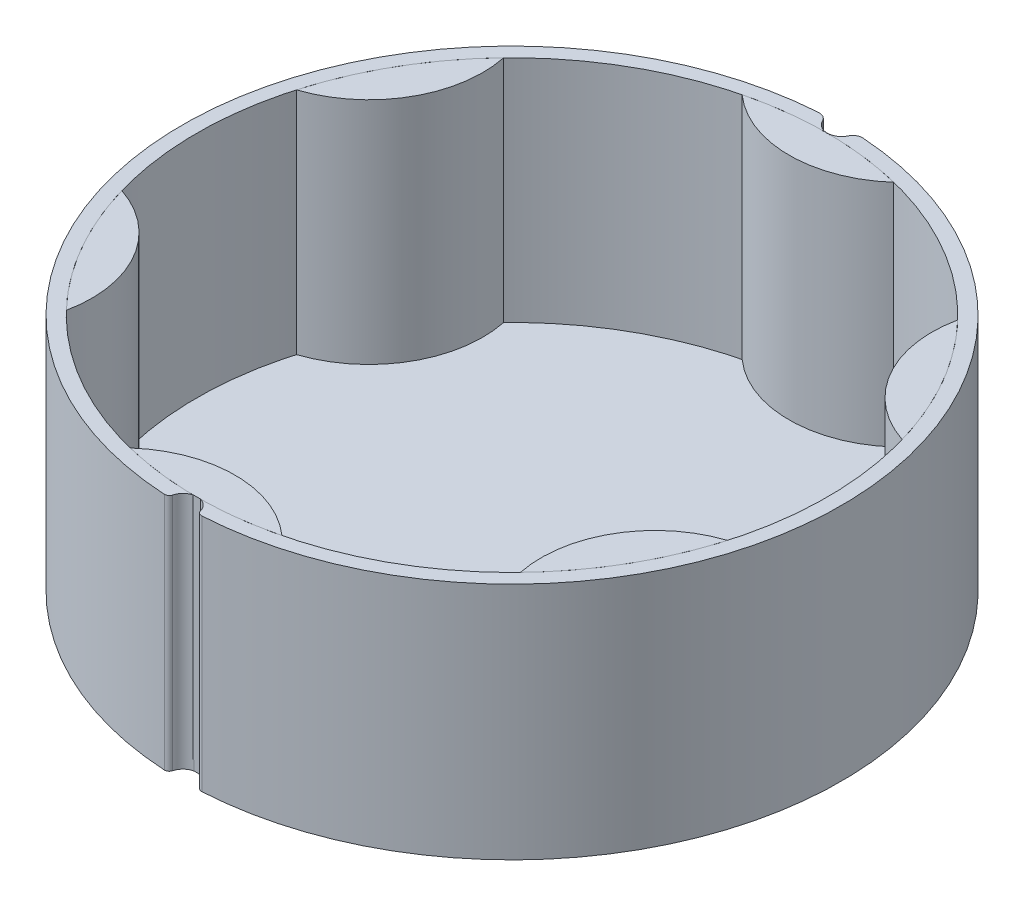
ISO-10303-21;
HEADER;
FILE_DESCRIPTION(('STEP AP214'),'2;1');
FILE_NAME('part.step','',(''),(''),'','','');
FILE_SCHEMA(('AUTOMOTIVE_DESIGN { 1 0 10303 214 1 1 1 1 }'));
ENDSEC;
DATA;
#1=APPLICATION_CONTEXT('core data for automotive mechanical design processes');
#2=APPLICATION_PROTOCOL_DEFINITION('international standard','automotive_design',2000,#1);
#3=PRODUCT_CONTEXT('',#1,'mechanical');
#4=PRODUCT('Part','Part','',(#3));
#5=PRODUCT_RELATED_PRODUCT_CATEGORY('part','',(#4));
#6=PRODUCT_DEFINITION_FORMATION('','',#4);
#7=PRODUCT_DEFINITION_CONTEXT('part definition',#1,'design');
#8=PRODUCT_DEFINITION('design','',#6,#7);
#9=PRODUCT_DEFINITION_SHAPE('','',#8);
#10=(LENGTH_UNIT() NAMED_UNIT(*) SI_UNIT(.MILLI.,.METRE.));
#11=(NAMED_UNIT(*) PLANE_ANGLE_UNIT() SI_UNIT($,.RADIAN.));
#12=(NAMED_UNIT(*) SI_UNIT($,.STERADIAN.) SOLID_ANGLE_UNIT());
#13=UNCERTAINTY_MEASURE_WITH_UNIT(LENGTH_MEASURE(1.E-05),#10,'distance_accuracy_value','');
#14=(GEOMETRIC_REPRESENTATION_CONTEXT(3) GLOBAL_UNCERTAINTY_ASSIGNED_CONTEXT((#13)) GLOBAL_UNIT_ASSIGNED_CONTEXT((#10,
#11,#12)) REPRESENTATION_CONTEXT('',''));
#15=CARTESIAN_POINT('',(0.,0.,0.));
#16=DIRECTION('',(0.,0.,1.));
#17=DIRECTION('',(1.,0.,0.));
#18=AXIS2_PLACEMENT_3D('',#15,#16,#17);
#19=CARTESIAN_POINT('',(0.,41.3779959441881,0.));
#20=DIRECTION('',(0.,-1.,0.));
#21=DIRECTION('',(0.866025403784433,0.,-0.50000000000001));
#22=AXIS2_PLACEMENT_3D('',#19,#20,#21);
#23=CYLINDRICAL_SURFACE('',#22,33.);
#24=CARTESIAN_POINT('',(0.,25.,0.));
#25=DIRECTION('',(0.,1.,0.));
#26=DIRECTION('',(-0.866025403784433,0.,0.50000000000001));
#27=AXIS2_PLACEMENT_3D('',#24,#25,#26);
#28=CIRCLE('',#27,33.);
#29=CARTESIAN_POINT('',(31.7095626252552,25.,-9.13803250787709));
#30=VERTEX_POINT('',#29);
#31=CARTESIAN_POINT('',(23.7685496050566,25.,-22.8922705224266));
#32=VERTEX_POINT('',#31);
#33=EDGE_CURVE('E13',#30,#32,#28,.T.);
#34=ORIENTED_EDGE('',*,*,#33,.F.);
#35=DIRECTION('',(0.,-1.,0.));
#36=VECTOR('',#35,1.);
#37=CARTESIAN_POINT('',(31.7095626252552,41.3779959441881,-9.13803250787709));
#38=LINE('',#37,#36);
#39=CARTESIAN_POINT('',(31.7095626252552,0.,-9.13803250787709));
#40=VERTEX_POINT('',#39);
#41=EDGE_CURVE('E64',#30,#40,#38,.T.);
#42=ORIENTED_EDGE('',*,*,#41,.T.);
#43=CARTESIAN_POINT('',(0.,0.,0.));
#44=DIRECTION('',(0.,1.,0.));
#45=DIRECTION('',(-0.866025403784433,0.,0.50000000000001));
#46=AXIS2_PLACEMENT_3D('',#43,#44,#45);
#47=CIRCLE('',#46,33.);
#48=CARTESIAN_POINT('',(23.7685496050566,0.,-22.8922705224266));
#49=VERTEX_POINT('',#48);
#50=EDGE_CURVE('E89',#40,#49,#47,.T.);
#51=ORIENTED_EDGE('',*,*,#50,.T.);
#52=DIRECTION('',(0.,-1.,0.));
#53=VECTOR('',#52,1.);
#54=CARTESIAN_POINT('',(23.7685496050566,41.3779959441881,-22.8922705224266));
#55=LINE('',#54,#53);
#56=EDGE_CURVE('E81',#32,#49,#55,.T.);
#57=ORIENTED_EDGE('',*,*,#56,.F.);
#58=EDGE_LOOP('',(#34,#42,#51,#57));
#59=FACE_BOUND('',#58,.T.);
#60=ADVANCED_FACE('F60',(#59),#23,.T.);
#61=CARTESIAN_POINT('',(35.437759522859,41.3779959441881,-20.4600000000004));
#62=DIRECTION('',(0.,-1.,0.));
#63=DIRECTION('',(0.866025403784433,0.,-0.50000000000001));
#64=AXIS2_PLACEMENT_3D('',#61,#62,#63);
#65=CYLINDRICAL_SURFACE('',#64,11.92);
#66=CARTESIAN_POINT('',(35.437759522859,25.,-20.4600000000004));
#67=DIRECTION('',(0.,1.,0.));
#68=DIRECTION('',(-0.866025403784433,0.,0.50000000000001));
#69=AXIS2_PLACEMENT_3D('',#66,#67,#68);
#70=CIRCLE('',#69,11.92);
#71=EDGE_CURVE('E69',#32,#30,#70,.T.);
#72=ORIENTED_EDGE('',*,*,#71,.F.);
#73=ORIENTED_EDGE('',*,*,#56,.T.);
#74=CARTESIAN_POINT('',(35.437759522859,0.,-20.4600000000004));
#75=DIRECTION('',(0.,1.,0.));
#76=DIRECTION('',(-0.866025403784433,0.,0.50000000000001));
#77=AXIS2_PLACEMENT_3D('',#74,#75,#76);
#78=CIRCLE('',#77,11.92);
#79=EDGE_CURVE('E91',#49,#40,#78,.T.);
#80=ORIENTED_EDGE('',*,*,#79,.T.);
#81=ORIENTED_EDGE('',*,*,#41,.F.);
#82=EDGE_LOOP('',(#72,#73,#80,#81));
#83=FACE_BOUND('',#82,.T.);
#84=ADVANCED_FACE('F92',(#83),#65,.T.);
#85=CARTESIAN_POINT('',(0.,0.,0.));
#86=DIRECTION('',(0.,1.,0.));
#87=DIRECTION('',(-0.866025403784433,0.,0.50000000000001));
#88=AXIS2_PLACEMENT_3D('',#85,#86,#87);
#89=PLANE('',#88);
#90=ORIENTED_EDGE('',*,*,#50,.F.);
#91=ORIENTED_EDGE('',*,*,#79,.F.);
#92=EDGE_LOOP('',(#90,#91));
#93=FACE_BOUND('',#92,.T.);
#94=ADVANCED_FACE('F95',(#93),#89,.F.);
#95=CARTESIAN_POINT('',(0.,25.,0.));
#96=DIRECTION('',(0.,1.,0.));
#97=DIRECTION('',(-0.866025403784433,0.,0.50000000000001));
#98=AXIS2_PLACEMENT_3D('',#95,#96,#97);
#99=PLANE('',#98);
#100=ORIENTED_EDGE('',*,*,#71,.T.);
#101=ORIENTED_EDGE('',*,*,#33,.T.);
#102=EDGE_LOOP('',(#100,#101));
#103=FACE_BOUND('',#102,.T.);
#104=ADVANCED_FACE('F62',(#103),#99,.T.);
#105=CLOSED_SHELL('',(#60,#84,#94,#104));
#106=MANIFOLD_SOLID_BREP('B2',#105);
#107=CARTESIAN_POINT('',(0.,41.3779959441881,0.));
#108=DIRECTION('',(0.,-1.,0.));
#109=DIRECTION('',(0.866025403784443,0.,0.499999999999992));
#110=AXIS2_PLACEMENT_3D('',#107,#108,#109);
#111=CYLINDRICAL_SURFACE('',#110,33.);
#112=CARTESIAN_POINT('',(0.,25.,0.));
#113=DIRECTION('',(0.,1.,0.));
#114=DIRECTION('',(-0.866025403784443,0.,-0.499999999999992));
#115=AXIS2_PLACEMENT_3D('',#112,#113,#114);
#116=CIRCLE('',#115,33.);
#117=CARTESIAN_POINT('',(23.7685496050571,25.,22.8922705224261));
#118=VERTEX_POINT('',#117);
#119=CARTESIAN_POINT('',(31.7095626252554,25.,9.13803250787642));
#120=VERTEX_POINT('',#119);
#121=EDGE_CURVE('E58',#118,#120,#116,.T.);
#122=ORIENTED_EDGE('',*,*,#121,.F.);
#123=DIRECTION('',(0.,-1.,0.));
#124=VECTOR('',#123,1.);
#125=CARTESIAN_POINT('',(23.7685496050571,41.3779959441881,22.8922705224261));
#126=LINE('',#125,#124);
#127=CARTESIAN_POINT('',(23.7685496050571,0.,22.8922705224261));
#128=VERTEX_POINT('',#127);
#129=EDGE_CURVE('E153',#118,#128,#126,.T.);
#130=ORIENTED_EDGE('',*,*,#129,.T.);
#131=CARTESIAN_POINT('',(0.,0.,0.));
#132=DIRECTION('',(0.,1.,0.));
#133=DIRECTION('',(-0.866025403784443,0.,-0.499999999999992));
#134=AXIS2_PLACEMENT_3D('',#131,#132,#133);
#135=CIRCLE('',#134,33.);
#136=CARTESIAN_POINT('',(31.7095626252554,0.,9.13803250787642));
#137=VERTEX_POINT('',#136);
#138=EDGE_CURVE('E178',#128,#137,#135,.T.);
#139=ORIENTED_EDGE('',*,*,#138,.T.);
#140=DIRECTION('',(0.,-1.,0.));
#141=VECTOR('',#140,1.);
#142=CARTESIAN_POINT('',(31.7095626252554,41.3779959441881,9.13803250787642));
#143=LINE('',#142,#141);
#144=EDGE_CURVE('E170',#120,#137,#143,.T.);
#145=ORIENTED_EDGE('',*,*,#144,.F.);
#146=EDGE_LOOP('',(#122,#130,#139,#145));
#147=FACE_BOUND('',#146,.T.);
#148=ADVANCED_FACE('F149',(#147),#111,.T.);
#149=CARTESIAN_POINT('',(35.4377595228594,41.3779959441881,20.4599999999997));
#150=DIRECTION('',(0.,-1.,0.));
#151=DIRECTION('',(0.866025403784443,0.,0.499999999999992));
#152=AXIS2_PLACEMENT_3D('',#149,#150,#151);
#153=CYLINDRICAL_SURFACE('',#152,11.92);
#154=CARTESIAN_POINT('',(35.4377595228594,25.,20.4599999999997));
#155=DIRECTION('',(0.,1.,0.));
#156=DIRECTION('',(-0.866025403784443,0.,-0.499999999999992));
#157=AXIS2_PLACEMENT_3D('',#154,#155,#156);
#158=CIRCLE('',#157,11.92);
#159=EDGE_CURVE('E158',#120,#118,#158,.T.);
#160=ORIENTED_EDGE('',*,*,#159,.F.);
#161=ORIENTED_EDGE('',*,*,#144,.T.);
#162=CARTESIAN_POINT('',(35.4377595228594,0.,20.4599999999997));
#163=DIRECTION('',(0.,1.,0.));
#164=DIRECTION('',(-0.866025403784443,0.,-0.499999999999992));
#165=AXIS2_PLACEMENT_3D('',#162,#163,#164);
#166=CIRCLE('',#165,11.92);
#167=EDGE_CURVE('E180',#137,#128,#166,.T.);
#168=ORIENTED_EDGE('',*,*,#167,.T.);
#169=ORIENTED_EDGE('',*,*,#129,.F.);
#170=EDGE_LOOP('',(#160,#161,#168,#169));
#171=FACE_BOUND('',#170,.T.);
#172=ADVANCED_FACE('F181',(#171),#153,.T.);
#173=CARTESIAN_POINT('',(0.,0.,0.));
#174=DIRECTION('',(0.,1.,0.));
#175=DIRECTION('',(-0.866025403784443,0.,-0.499999999999992));
#176=AXIS2_PLACEMENT_3D('',#173,#174,#175);
#177=PLANE('',#176);
#178=ORIENTED_EDGE('',*,*,#138,.F.);
#179=ORIENTED_EDGE('',*,*,#167,.F.);
#180=EDGE_LOOP('',(#178,#179));
#181=FACE_BOUND('',#180,.T.);
#182=ADVANCED_FACE('F184',(#181),#177,.F.);
#183=CARTESIAN_POINT('',(0.,25.,0.));
#184=DIRECTION('',(0.,1.,0.));
#185=DIRECTION('',(-0.866025403784443,0.,-0.499999999999992));
#186=AXIS2_PLACEMENT_3D('',#183,#184,#185);
#187=PLANE('',#186);
#188=ORIENTED_EDGE('',*,*,#159,.T.);
#189=ORIENTED_EDGE('',*,*,#121,.T.);
#190=EDGE_LOOP('',(#188,#189));
#191=FACE_BOUND('',#190,.T.);
#192=ADVANCED_FACE('F151',(#191),#187,.T.);
#193=CLOSED_SHELL('',(#148,#172,#182,#192));
#194=MANIFOLD_SOLID_BREP('B7',#193);
#195=CARTESIAN_POINT('',(0.,41.3779959441881,0.));
#196=DIRECTION('',(0.,-1.,0.));
#197=DIRECTION('',(0.,0.,1.));
#198=AXIS2_PLACEMENT_3D('',#195,#196,#197);
#199=CYLINDRICAL_SURFACE('',#198,33.);
#200=CARTESIAN_POINT('',(0.,25.,0.));
#201=DIRECTION('',(0.,1.,0.));
#202=DIRECTION('',(0.,0.,-1.));
#203=AXIS2_PLACEMENT_3D('',#200,#201,#202);
#204=CIRCLE('',#203,33.);
#205=CARTESIAN_POINT('',(-7.94101302019839,25.,32.030303030303));
#206=VERTEX_POINT('',#205);
#207=CARTESIAN_POINT('',(7.9410130201984,25.,32.030303030303));
#208=VERTEX_POINT('',#207);
#209=EDGE_CURVE('E147',#206,#208,#204,.T.);
#210=ORIENTED_EDGE('',*,*,#209,.F.);
#211=DIRECTION('',(0.,-1.,0.));
#212=VECTOR('',#211,1.);
#213=CARTESIAN_POINT('',(-7.9410130201984,41.3779959441881,32.030303030303));
#214=LINE('',#213,#212);
#215=CARTESIAN_POINT('',(-7.9410130201984,0.,32.030303030303));
#216=VERTEX_POINT('',#215);
#217=EDGE_CURVE('E242',#206,#216,#214,.T.);
#218=ORIENTED_EDGE('',*,*,#217,.T.);
#219=CARTESIAN_POINT('',(0.,0.,0.));
#220=DIRECTION('',(0.,1.,0.));
#221=DIRECTION('',(0.,0.,-1.));
#222=AXIS2_PLACEMENT_3D('',#219,#220,#221);
#223=CIRCLE('',#222,33.);
#224=CARTESIAN_POINT('',(7.9410130201984,0.,32.030303030303));
#225=VERTEX_POINT('',#224);
#226=EDGE_CURVE('E267',#216,#225,#223,.T.);
#227=ORIENTED_EDGE('',*,*,#226,.T.);
#228=DIRECTION('',(0.,-1.,0.));
#229=VECTOR('',#228,1.);
#230=CARTESIAN_POINT('',(7.9410130201984,41.3779959441881,32.030303030303));
#231=LINE('',#230,#229);
#232=EDGE_CURVE('E259',#208,#225,#231,.T.);
#233=ORIENTED_EDGE('',*,*,#232,.F.);
#234=EDGE_LOOP('',(#210,#218,#227,#233));
#235=FACE_BOUND('',#234,.T.);
#236=ADVANCED_FACE('F238',(#235),#199,.T.);
#237=CARTESIAN_POINT('',(0.,41.3779959441881,40.92));
#238=DIRECTION('',(0.,-1.,0.));
#239=DIRECTION('',(0.,0.,1.));
#240=AXIS2_PLACEMENT_3D('',#237,#238,#239);
#241=CYLINDRICAL_SURFACE('',#240,11.92);
#242=CARTESIAN_POINT('',(0.,25.,40.92));
#243=DIRECTION('',(0.,1.,0.));
#244=DIRECTION('',(0.,0.,-1.));
#245=AXIS2_PLACEMENT_3D('',#242,#243,#244);
#246=CIRCLE('',#245,11.92);
#247=EDGE_CURVE('E247',#208,#206,#246,.T.);
#248=ORIENTED_EDGE('',*,*,#247,.F.);
#249=ORIENTED_EDGE('',*,*,#232,.T.);
#250=CARTESIAN_POINT('',(0.,0.,40.92));
#251=DIRECTION('',(0.,1.,0.));
#252=DIRECTION('',(0.,0.,-1.));
#253=AXIS2_PLACEMENT_3D('',#250,#251,#252);
#254=CIRCLE('',#253,11.92);
#255=EDGE_CURVE('E269',#225,#216,#254,.T.);
#256=ORIENTED_EDGE('',*,*,#255,.T.);
#257=ORIENTED_EDGE('',*,*,#217,.F.);
#258=EDGE_LOOP('',(#248,#249,#256,#257));
#259=FACE_BOUND('',#258,.T.);
#260=ADVANCED_FACE('F270',(#259),#241,.T.);
#261=CARTESIAN_POINT('',(0.,0.,0.));
#262=DIRECTION('',(0.,1.,0.));
#263=DIRECTION('',(0.,0.,-1.));
#264=AXIS2_PLACEMENT_3D('',#261,#262,#263);
#265=PLANE('',#264);
#266=ORIENTED_EDGE('',*,*,#226,.F.);
#267=ORIENTED_EDGE('',*,*,#255,.F.);
#268=EDGE_LOOP('',(#266,#267));
#269=FACE_BOUND('',#268,.T.);
#270=ADVANCED_FACE('F273',(#269),#265,.F.);
#271=CARTESIAN_POINT('',(0.,25.,0.));
#272=DIRECTION('',(0.,1.,0.));
#273=DIRECTION('',(0.,0.,-1.));
#274=AXIS2_PLACEMENT_3D('',#271,#272,#273);
#275=PLANE('',#274);
#276=ORIENTED_EDGE('',*,*,#247,.T.);
#277=ORIENTED_EDGE('',*,*,#209,.T.);
#278=EDGE_LOOP('',(#276,#277));
#279=FACE_BOUND('',#278,.T.);
#280=ADVANCED_FACE('F240',(#279),#275,.T.);
#281=CLOSED_SHELL('',(#236,#260,#270,#280));
#282=MANIFOLD_SOLID_BREP('B52',#281);
#283=CARTESIAN_POINT('',(0.,41.3779959441881,0.));
#284=DIRECTION('',(0.,-1.,0.));
#285=DIRECTION('',(-0.866025403784436,0.,0.500000000000004));
#286=AXIS2_PLACEMENT_3D('',#283,#284,#285);
#287=CYLINDRICAL_SURFACE('',#286,33.);
#288=CARTESIAN_POINT('',(0.,25.,0.));
#289=DIRECTION('',(0.,1.,0.));
#290=DIRECTION('',(0.866025403784436,0.,-0.500000000000004));
#291=AXIS2_PLACEMENT_3D('',#288,#289,#290);
#292=CIRCLE('',#291,33.);
#293=CARTESIAN_POINT('',(-31.7095626252553,25.,9.13803250787687));
#294=VERTEX_POINT('',#293);
#295=CARTESIAN_POINT('',(-23.7685496050568,25.,22.8922705224264));
#296=VERTEX_POINT('',#295);
#297=EDGE_CURVE('E236',#294,#296,#292,.T.);
#298=ORIENTED_EDGE('',*,*,#297,.F.);
#299=DIRECTION('',(0.,-1.,0.));
#300=VECTOR('',#299,1.);
#301=CARTESIAN_POINT('',(-31.7095626252553,41.3779959441881,9.13803250787687));
#302=LINE('',#301,#300);
#303=CARTESIAN_POINT('',(-31.7095626252553,0.,9.13803250787687));
#304=VERTEX_POINT('',#303);
#305=EDGE_CURVE('E331',#294,#304,#302,.T.);
#306=ORIENTED_EDGE('',*,*,#305,.T.);
#307=CARTESIAN_POINT('',(0.,0.,0.));
#308=DIRECTION('',(0.,1.,0.));
#309=DIRECTION('',(0.866025403784436,0.,-0.500000000000004));
#310=AXIS2_PLACEMENT_3D('',#307,#308,#309);
#311=CIRCLE('',#310,33.);
#312=CARTESIAN_POINT('',(-23.7685496050568,0.,22.8922705224264));
#313=VERTEX_POINT('',#312);
#314=EDGE_CURVE('E356',#304,#313,#311,.T.);
#315=ORIENTED_EDGE('',*,*,#314,.T.);
#316=DIRECTION('',(0.,-1.,0.));
#317=VECTOR('',#316,1.);
#318=CARTESIAN_POINT('',(-23.7685496050568,41.3779959441881,22.8922705224264));
#319=LINE('',#318,#317);
#320=EDGE_CURVE('E348',#296,#313,#319,.T.);
#321=ORIENTED_EDGE('',*,*,#320,.F.);
#322=EDGE_LOOP('',(#298,#306,#315,#321));
#323=FACE_BOUND('',#322,.T.);
#324=ADVANCED_FACE('F327',(#323),#287,.T.);
#325=CARTESIAN_POINT('',(-35.4377595228591,41.3779959441881,20.4600000000002));
#326=DIRECTION('',(0.,-1.,0.));
#327=DIRECTION('',(-0.866025403784436,0.,0.500000000000004));
#328=AXIS2_PLACEMENT_3D('',#325,#326,#327);
#329=CYLINDRICAL_SURFACE('',#328,11.92);
#330=CARTESIAN_POINT('',(-35.4377595228591,25.,20.4600000000002));
#331=DIRECTION('',(0.,1.,0.));
#332=DIRECTION('',(0.866025403784436,0.,-0.500000000000004));
#333=AXIS2_PLACEMENT_3D('',#330,#331,#332);
#334=CIRCLE('',#333,11.92);
#335=EDGE_CURVE('E336',#296,#294,#334,.T.);
#336=ORIENTED_EDGE('',*,*,#335,.F.);
#337=ORIENTED_EDGE('',*,*,#320,.T.);
#338=CARTESIAN_POINT('',(-35.4377595228591,0.,20.4600000000002));
#339=DIRECTION('',(0.,1.,0.));
#340=DIRECTION('',(0.866025403784436,0.,-0.500000000000004));
#341=AXIS2_PLACEMENT_3D('',#338,#339,#340);
#342=CIRCLE('',#341,11.92);
#343=EDGE_CURVE('E358',#313,#304,#342,.T.);
#344=ORIENTED_EDGE('',*,*,#343,.T.);
#345=ORIENTED_EDGE('',*,*,#305,.F.);
#346=EDGE_LOOP('',(#336,#337,#344,#345));
#347=FACE_BOUND('',#346,.T.);
#348=ADVANCED_FACE('F359',(#347),#329,.T.);
#349=CARTESIAN_POINT('',(0.,0.,0.));
#350=DIRECTION('',(0.,1.,0.));
#351=DIRECTION('',(0.866025403784436,0.,-0.500000000000004));
#352=AXIS2_PLACEMENT_3D('',#349,#350,#351);
#353=PLANE('',#352);
#354=ORIENTED_EDGE('',*,*,#314,.F.);
#355=ORIENTED_EDGE('',*,*,#343,.F.);
#356=EDGE_LOOP('',(#354,#355));
#357=FACE_BOUND('',#356,.T.);
#358=ADVANCED_FACE('F362',(#357),#353,.F.);
#359=CARTESIAN_POINT('',(0.,25.,0.));
#360=DIRECTION('',(0.,1.,0.));
#361=DIRECTION('',(0.866025403784436,0.,-0.500000000000004));
#362=AXIS2_PLACEMENT_3D('',#359,#360,#361);
#363=PLANE('',#362);
#364=ORIENTED_EDGE('',*,*,#335,.T.);
#365=ORIENTED_EDGE('',*,*,#297,.T.);
#366=EDGE_LOOP('',(#364,#365));
#367=FACE_BOUND('',#366,.T.);
#368=ADVANCED_FACE('F329',(#367),#363,.T.);
#369=CLOSED_SHELL('',(#324,#348,#358,#368));
#370=MANIFOLD_SOLID_BREP('B141',#369);
#371=CARTESIAN_POINT('',(0.,41.3779959441881,0.));
#372=DIRECTION('',(0.,-1.,0.));
#373=DIRECTION('',(-0.86602540378444,0.,-0.499999999999998));
#374=AXIS2_PLACEMENT_3D('',#371,#372,#373);
#375=CYLINDRICAL_SURFACE('',#374,33.);
#376=CARTESIAN_POINT('',(0.,25.,0.));
#377=DIRECTION('',(0.,1.,0.));
#378=DIRECTION('',(0.86602540378444,0.,0.499999999999998));
#379=AXIS2_PLACEMENT_3D('',#376,#377,#378);
#380=CIRCLE('',#379,33.);
#381=CARTESIAN_POINT('',(-23.768549605057,25.,-22.8922705224263));
#382=VERTEX_POINT('',#381);
#383=CARTESIAN_POINT('',(-31.7095626252553,25.,-9.13803250787664));
#384=VERTEX_POINT('',#383);
#385=EDGE_CURVE('E325',#382,#384,#380,.T.);
#386=ORIENTED_EDGE('',*,*,#385,.F.);
#387=DIRECTION('',(0.,-1.,0.));
#388=VECTOR('',#387,1.);
#389=CARTESIAN_POINT('',(-23.768549605057,41.3779959441881,-22.8922705224263));
#390=LINE('',#389,#388);
#391=CARTESIAN_POINT('',(-23.768549605057,0.,-22.8922705224263));
#392=VERTEX_POINT('',#391);
#393=EDGE_CURVE('E420',#382,#392,#390,.T.);
#394=ORIENTED_EDGE('',*,*,#393,.T.);
#395=CARTESIAN_POINT('',(0.,0.,0.));
#396=DIRECTION('',(0.,1.,0.));
#397=DIRECTION('',(0.86602540378444,0.,0.499999999999998));
#398=AXIS2_PLACEMENT_3D('',#395,#396,#397);
#399=CIRCLE('',#398,33.);
#400=CARTESIAN_POINT('',(-31.7095626252553,0.,-9.13803250787664));
#401=VERTEX_POINT('',#400);
#402=EDGE_CURVE('E445',#392,#401,#399,.T.);
#403=ORIENTED_EDGE('',*,*,#402,.T.);
#404=DIRECTION('',(0.,-1.,0.));
#405=VECTOR('',#404,1.);
#406=CARTESIAN_POINT('',(-31.7095626252553,41.3779959441881,-9.13803250787664));
#407=LINE('',#406,#405);
#408=EDGE_CURVE('E437',#384,#401,#407,.T.);
#409=ORIENTED_EDGE('',*,*,#408,.F.);
#410=EDGE_LOOP('',(#386,#394,#403,#409));
#411=FACE_BOUND('',#410,.T.);
#412=ADVANCED_FACE('F416',(#411),#375,.T.);
#413=CARTESIAN_POINT('',(-35.4377595228593,41.3779959441881,-20.4599999999999));
#414=DIRECTION('',(0.,-1.,0.));
#415=DIRECTION('',(-0.86602540378444,0.,-0.499999999999998));
#416=AXIS2_PLACEMENT_3D('',#413,#414,#415);
#417=CYLINDRICAL_SURFACE('',#416,11.92);
#418=CARTESIAN_POINT('',(-35.4377595228593,25.,-20.4599999999999));
#419=DIRECTION('',(0.,1.,0.));
#420=DIRECTION('',(0.86602540378444,0.,0.499999999999998));
#421=AXIS2_PLACEMENT_3D('',#418,#419,#420);
#422=CIRCLE('',#421,11.92);
#423=EDGE_CURVE('E425',#384,#382,#422,.T.);
#424=ORIENTED_EDGE('',*,*,#423,.F.);
#425=ORIENTED_EDGE('',*,*,#408,.T.);
#426=CARTESIAN_POINT('',(-35.4377595228593,0.,-20.4599999999999));
#427=DIRECTION('',(0.,1.,0.));
#428=DIRECTION('',(0.86602540378444,0.,0.499999999999998));
#429=AXIS2_PLACEMENT_3D('',#426,#427,#428);
#430=CIRCLE('',#429,11.92);
#431=EDGE_CURVE('E447',#401,#392,#430,.T.);
#432=ORIENTED_EDGE('',*,*,#431,.T.);
#433=ORIENTED_EDGE('',*,*,#393,.F.);
#434=EDGE_LOOP('',(#424,#425,#432,#433));
#435=FACE_BOUND('',#434,.T.);
#436=ADVANCED_FACE('F448',(#435),#417,.T.);
#437=CARTESIAN_POINT('',(0.,0.,0.));
#438=DIRECTION('',(0.,1.,0.));
#439=DIRECTION('',(0.86602540378444,0.,0.499999999999998));
#440=AXIS2_PLACEMENT_3D('',#437,#438,#439);
#441=PLANE('',#440);
#442=ORIENTED_EDGE('',*,*,#402,.F.);
#443=ORIENTED_EDGE('',*,*,#431,.F.);
#444=EDGE_LOOP('',(#442,#443));
#445=FACE_BOUND('',#444,.T.);
#446=ADVANCED_FACE('F451',(#445),#441,.F.);
#447=CARTESIAN_POINT('',(0.,25.,0.));
#448=DIRECTION('',(0.,1.,0.));
#449=DIRECTION('',(0.86602540378444,0.,0.499999999999998));
#450=AXIS2_PLACEMENT_3D('',#447,#448,#449);
#451=PLANE('',#450);
#452=ORIENTED_EDGE('',*,*,#423,.T.);
#453=ORIENTED_EDGE('',*,*,#385,.T.);
#454=EDGE_LOOP('',(#452,#453));
#455=FACE_BOUND('',#454,.T.);
#456=ADVANCED_FACE('F418',(#455),#451,.T.);
#457=CLOSED_SHELL('',(#412,#436,#446,#456));
#458=MANIFOLD_SOLID_BREP('B230',#457);
#459=CARTESIAN_POINT('',(0.,41.3779959441881,0.));
#460=DIRECTION('',(0.,-1.,0.));
#461=DIRECTION('',(0.,0.,-1.));
#462=AXIS2_PLACEMENT_3D('',#459,#460,#461);
#463=CYLINDRICAL_SURFACE('',#462,33.);
#464=CARTESIAN_POINT('',(0.,25.,0.));
#465=DIRECTION('',(0.,1.,0.));
#466=DIRECTION('',(0.,0.,1.));
#467=AXIS2_PLACEMENT_3D('',#464,#465,#466);
#468=CIRCLE('',#467,33.);
#469=CARTESIAN_POINT('',(7.94101302019839,25.,-32.030303030303));
#470=VERTEX_POINT('',#469);
#471=CARTESIAN_POINT('',(-7.9410130201984,25.,-32.030303030303));
#472=VERTEX_POINT('',#471);
#473=EDGE_CURVE('E414',#470,#472,#468,.T.);
#474=ORIENTED_EDGE('',*,*,#473,.F.);
#475=DIRECTION('',(0.,-1.,0.));
#476=VECTOR('',#475,1.);
#477=CARTESIAN_POINT('',(7.9410130201984,41.3779959441881,-32.030303030303));
#478=LINE('',#477,#476);
#479=CARTESIAN_POINT('',(7.9410130201984,0.,-32.030303030303));
#480=VERTEX_POINT('',#479);
#481=EDGE_CURVE('E508',#470,#480,#478,.T.);
#482=ORIENTED_EDGE('',*,*,#481,.T.);
#483=CARTESIAN_POINT('',(0.,0.,0.));
#484=DIRECTION('',(0.,1.,0.));
#485=DIRECTION('',(0.,0.,1.));
#486=AXIS2_PLACEMENT_3D('',#483,#484,#485);
#487=CIRCLE('',#486,33.);
#488=CARTESIAN_POINT('',(-7.9410130201984,0.,-32.030303030303));
#489=VERTEX_POINT('',#488);
#490=EDGE_CURVE('E533',#480,#489,#487,.T.);
#491=ORIENTED_EDGE('',*,*,#490,.T.);
#492=DIRECTION('',(0.,-1.,0.));
#493=VECTOR('',#492,1.);
#494=CARTESIAN_POINT('',(-7.9410130201984,41.3779959441881,-32.030303030303));
#495=LINE('',#494,#493);
#496=EDGE_CURVE('E525',#472,#489,#495,.T.);
#497=ORIENTED_EDGE('',*,*,#496,.F.);
#498=EDGE_LOOP('',(#474,#482,#491,#497));
#499=FACE_BOUND('',#498,.T.);
#500=ADVANCED_FACE('F504',(#499),#463,.T.);
#501=CARTESIAN_POINT('',(0.,41.3779959441881,-40.92));
#502=DIRECTION('',(0.,-1.,0.));
#503=DIRECTION('',(0.,0.,-1.));
#504=AXIS2_PLACEMENT_3D('',#501,#502,#503);
#505=CYLINDRICAL_SURFACE('',#504,11.92);
#506=CARTESIAN_POINT('',(0.,25.,-40.92));
#507=DIRECTION('',(0.,1.,0.));
#508=DIRECTION('',(0.,0.,1.));
#509=AXIS2_PLACEMENT_3D('',#506,#507,#508);
#510=CIRCLE('',#509,11.92);
#511=EDGE_CURVE('E513',#472,#470,#510,.T.);
#512=ORIENTED_EDGE('',*,*,#511,.F.);
#513=ORIENTED_EDGE('',*,*,#496,.T.);
#514=CARTESIAN_POINT('',(0.,0.,-40.92));
#515=DIRECTION('',(0.,1.,0.));
#516=DIRECTION('',(0.,0.,1.));
#517=AXIS2_PLACEMENT_3D('',#514,#515,#516);
#518=CIRCLE('',#517,11.92);
#519=EDGE_CURVE('E535',#489,#480,#518,.T.);
#520=ORIENTED_EDGE('',*,*,#519,.T.);
#521=ORIENTED_EDGE('',*,*,#481,.F.);
#522=EDGE_LOOP('',(#512,#513,#520,#521));
#523=FACE_BOUND('',#522,.T.);
#524=ADVANCED_FACE('F536',(#523),#505,.T.);
#525=CARTESIAN_POINT('',(0.,0.,0.));
#526=DIRECTION('',(0.,1.,0.));
#527=DIRECTION('',(0.,0.,1.));
#528=AXIS2_PLACEMENT_3D('',#525,#526,#527);
#529=PLANE('',#528);
#530=ORIENTED_EDGE('',*,*,#490,.F.);
#531=ORIENTED_EDGE('',*,*,#519,.F.);
#532=EDGE_LOOP('',(#530,#531));
#533=FACE_BOUND('',#532,.T.);
#534=ADVANCED_FACE('F539',(#533),#529,.F.);
#535=CARTESIAN_POINT('',(0.,25.,0.));
#536=DIRECTION('',(0.,1.,0.));
#537=DIRECTION('',(0.,0.,1.));
#538=AXIS2_PLACEMENT_3D('',#535,#536,#537);
#539=PLANE('',#538);
#540=ORIENTED_EDGE('',*,*,#511,.T.);
#541=ORIENTED_EDGE('',*,*,#473,.T.);
#542=EDGE_LOOP('',(#540,#541));
#543=FACE_BOUND('',#542,.T.);
#544=ADVANCED_FACE('F506',(#543),#539,.T.);
#545=CLOSED_SHELL('',(#500,#524,#534,#544));
#546=MANIFOLD_SOLID_BREP('B319',#545);
#547=CARTESIAN_POINT('',(0.,25.,34.4456799246862));
#548=DIRECTION('',(0.,-1.,0.));
#549=DIRECTION('',(0.,0.,-1.));
#550=AXIS2_PLACEMENT_3D('',#547,#548,#549);
#551=CYLINDRICAL_SURFACE('',#550,1.50000000000002);
#552=CARTESIAN_POINT('',(0.,25.,34.4456799246862));
#553=DIRECTION('',(0.,1.,0.));
#554=DIRECTION('',(0.,0.,1.));
#555=AXIS2_PLACEMENT_3D('',#552,#553,#554);
#556=CIRCLE('',#555,1.50000000000002);
#557=CARTESIAN_POINT('',(1.45181892540796,25.,34.0685568574689));
#558=VERTEX_POINT('',#557);
#559=CARTESIAN_POINT('',(0.39152086039591,25.,32.9976773639581));
#560=VERTEX_POINT('',#559);
#561=EDGE_CURVE('E737',#558,#560,#556,.T.);
#562=ORIENTED_EDGE('',*,*,#561,.T.);
#563=DIRECTION('',(0.,-1.,0.));
#564=VECTOR('',#563,1.);
#565=CARTESIAN_POINT('',(0.391520860396038,12.5,32.9976773639582));
#566=LINE('',#565,#564);
#567=CARTESIAN_POINT('',(0.391520860396048,1.,32.9976773639581));
#568=VERTEX_POINT('',#567);
#569=EDGE_CURVE('E598',#568,#560,#566,.F.);
#570=ORIENTED_EDGE('',*,*,#569,.F.);
#571=CARTESIAN_POINT('',(0.,1.,34.4456799246862));
#572=DIRECTION('',(0.,1.,0.));
#573=DIRECTION('',(0.,0.,1.));
#574=AXIS2_PLACEMENT_3D('',#571,#572,#573);
#575=CIRCLE('',#574,1.50000000000002);
#576=CARTESIAN_POINT('',(-0.391520860396048,1.,32.9976773639581));
#577=VERTEX_POINT('',#576);
#578=EDGE_CURVE('E891',#577,#568,#575,.F.);
#579=ORIENTED_EDGE('',*,*,#578,.F.);
#580=DIRECTION('',(0.,-1.,0.));
#581=VECTOR('',#580,1.);
#582=CARTESIAN_POINT('',(-0.391520860396038,12.5,32.9976773639582));
#583=LINE('',#582,#581);
#584=CARTESIAN_POINT('',(-0.391520860395912,25.,32.9976773639581));
#585=VERTEX_POINT('',#584);
#586=EDGE_CURVE('E884',#585,#577,#583,.T.);
#587=ORIENTED_EDGE('',*,*,#586,.F.);
#588=CARTESIAN_POINT('',(-1.45181892540796,25.,34.0685568574689));
#589=VERTEX_POINT('',#588);
#590=EDGE_CURVE('E647',#585,#589,#556,.T.);
#591=ORIENTED_EDGE('',*,*,#590,.T.);
#592=DIRECTION('',(0.,-1.,0.));
#593=VECTOR('',#592,1.);
#594=CARTESIAN_POINT('',(-1.45181892540796,25.,34.0685568574689));
#595=LINE('',#594,#593);
#596=CARTESIAN_POINT('',(-1.45181892540796,0.,34.0685568574689));
#597=VERTEX_POINT('',#596);
#598=EDGE_CURVE('E502',#589,#597,#595,.T.);
#599=ORIENTED_EDGE('',*,*,#598,.T.);
#600=CARTESIAN_POINT('',(0.,0.,34.4456799246862));
#601=DIRECTION('',(0.,1.,0.));
#602=DIRECTION('',(0.,0.,1.));
#603=AXIS2_PLACEMENT_3D('',#600,#601,#602);
#604=CIRCLE('',#603,1.50000000000002);
#605=CARTESIAN_POINT('',(1.45181892540796,0.,34.0685568574689));
#606=VERTEX_POINT('',#605);
#607=EDGE_CURVE('E696',#606,#597,#604,.T.);
#608=ORIENTED_EDGE('',*,*,#607,.F.);
#609=DIRECTION('',(0.,-1.,0.));
#610=VECTOR('',#609,1.);
#611=CARTESIAN_POINT('',(1.45181892540796,25.,34.0685568574689));
#612=LINE('',#611,#610);
#613=EDGE_CURVE('E591',#558,#606,#612,.T.);
#614=ORIENTED_EDGE('',*,*,#613,.F.);
#615=EDGE_LOOP('',(#562,#570,#579,#587,#591,#599,#608,#614));
#616=FACE_BOUND('',#615,.T.);
#617=ADVANCED_FACE('F583',(#616),#551,.F.);
#618=CARTESIAN_POINT('',(0.,25.,0.));
#619=DIRECTION('',(0.,1.,0.));
#620=DIRECTION('',(0.,0.,1.));
#621=AXIS2_PLACEMENT_3D('',#618,#619,#620);
#622=PLANE('',#621);
#623=ORIENTED_EDGE('',*,*,#590,.F.);
#624=CARTESIAN_POINT('',(0.,25.,0.));
#625=DIRECTION('',(0.,1.,0.));
#626=DIRECTION('',(0.,0.,1.));
#627=AXIS2_PLACEMENT_3D('',#624,#625,#626);
#628=CIRCLE('',#627,33.);
#629=EDGE_CURVE('E697',#560,#585,#628,.T.);
#630=ORIENTED_EDGE('',*,*,#629,.F.);
#631=ORIENTED_EDGE('',*,*,#561,.F.);
#632=CARTESIAN_POINT('',(1.93575856721061,25.,33.9428491683965));
#633=DIRECTION('',(0.,1.,0.));
#634=DIRECTION('',(0.,0.,1.));
#635=AXIS2_PLACEMENT_3D('',#632,#633,#634);
#636=CIRCLE('',#635,0.500000000000003);
#637=CARTESIAN_POINT('',(1.9642256049637,25.,34.4420381383884));
#638=VERTEX_POINT('',#637);
#639=EDGE_CURVE('E726',#558,#638,#636,.T.);
#640=ORIENTED_EDGE('',*,*,#639,.T.);
#641=CARTESIAN_POINT('',(0.,25.,-0.0020007910519898));
#642=DIRECTION('',(0.,1.,0.));
#643=DIRECTION('',(0.,0.,1.));
#644=AXIS2_PLACEMENT_3D('',#641,#642,#643);
#645=CIRCLE('',#644,34.5);
#646=CARTESIAN_POINT('',(2.32413582105506,25.,-34.4236276074198));
#647=VERTEX_POINT('',#646);
#648=EDGE_CURVE('E688',#638,#647,#645,.T.);
#649=ORIENTED_EDGE('',*,*,#648,.T.);
#650=CARTESIAN_POINT('',(2.2567695653723,25.,-33.4258992939019));
#651=DIRECTION('',(0.,1.,0.));
#652=DIRECTION('',(0.,0.,1.));
#653=AXIS2_PLACEMENT_3D('',#650,#651,#652);
#654=CIRCLE('',#653,1.);
#655=CARTESIAN_POINT('',(1.35406173922335,25.,-33.8561533823304));
#656=VERTEX_POINT('',#655);
#657=EDGE_CURVE('E686',#656,#647,#654,.F.);
#658=ORIENTED_EDGE('',*,*,#657,.F.);
#659=CARTESIAN_POINT('',(0.,25.,-34.5015345149731));
#660=DIRECTION('',(0.,1.,0.));
#661=DIRECTION('',(0.,0.,1.));
#662=AXIS2_PLACEMENT_3D('',#659,#660,#661);
#663=CIRCLE('',#662,1.49999999999991);
#664=CARTESIAN_POINT('',(-1.35406173922335,25.,-33.8561533823304));
#665=VERTEX_POINT('',#664);
#666=EDGE_CURVE('E670',#665,#656,#663,.T.);
#667=ORIENTED_EDGE('',*,*,#666,.F.);
#668=CARTESIAN_POINT('',(-2.2567695653723,25.,-33.4258992939019));
#669=DIRECTION('',(0.,1.,0.));
#670=DIRECTION('',(0.,0.,1.));
#671=AXIS2_PLACEMENT_3D('',#668,#669,#670);
#672=CIRCLE('',#671,1.);
#673=CARTESIAN_POINT('',(-2.32413582105505,25.,-34.4236276074198));
#674=VERTEX_POINT('',#673);
#675=EDGE_CURVE('E679',#665,#674,#672,.T.);
#676=ORIENTED_EDGE('',*,*,#675,.T.);
#677=CARTESIAN_POINT('',(0.,25.,-0.0020007910519898));
#678=DIRECTION('',(0.,1.,0.));
#679=DIRECTION('',(0.,0.,1.));
#680=AXIS2_PLACEMENT_3D('',#677,#678,#679);
#681=CIRCLE('',#680,34.5);
#682=CARTESIAN_POINT('',(-1.96422560496371,25.,34.4420381383884));
#683=VERTEX_POINT('',#682);
#684=EDGE_CURVE('E607',#674,#683,#681,.T.);
#685=ORIENTED_EDGE('',*,*,#684,.T.);
#686=CARTESIAN_POINT('',(-1.93575856721061,25.,33.9428491683965));
#687=DIRECTION('',(0.,1.,0.));
#688=DIRECTION('',(0.,0.,1.));
#689=AXIS2_PLACEMENT_3D('',#686,#687,#688);
#690=CIRCLE('',#689,0.500000000000003);
#691=EDGE_CURVE('E713',#589,#683,#690,.F.);
#692=ORIENTED_EDGE('',*,*,#691,.F.);
#693=EDGE_LOOP('',(#623,#630,#631,#640,#649,#658,#667,#676,#685,#692));
#694=FACE_BOUND('',#693,.T.);
#695=ADVANCED_FACE('F684',(#694),#622,.T.);
#696=CARTESIAN_POINT('',(-1.93575856721061,25.,33.9428491683965));
#697=DIRECTION('',(0.,-1.,0.));
#698=DIRECTION('',(0.,0.,-1.));
#699=AXIS2_PLACEMENT_3D('',#696,#697,#698);
#700=CYLINDRICAL_SURFACE('',#699,0.500000000000003);
#701=CARTESIAN_POINT('',(-1.93575856721061,0.,33.9428491683965));
#702=DIRECTION('',(0.,1.,0.));
#703=DIRECTION('',(0.,0.,1.));
#704=AXIS2_PLACEMENT_3D('',#701,#702,#703);
#705=CIRCLE('',#704,0.500000000000003);
#706=CARTESIAN_POINT('',(-1.96422560496371,0.,34.4420381383884));
#707=VERTEX_POINT('',#706);
#708=EDGE_CURVE('E693',#597,#707,#705,.F.);
#709=ORIENTED_EDGE('',*,*,#708,.F.);
#710=ORIENTED_EDGE('',*,*,#598,.F.);
#711=ORIENTED_EDGE('',*,*,#691,.T.);
#712=DIRECTION('',(0.,-1.,0.));
#713=VECTOR('',#712,1.);
#714=CARTESIAN_POINT('',(-1.96422560496371,25.,34.4420381383884));
#715=LINE('',#714,#713);
#716=EDGE_CURVE('E639',#683,#707,#715,.T.);
#717=ORIENTED_EDGE('',*,*,#716,.T.);
#718=EDGE_LOOP('',(#709,#710,#711,#717));
#719=FACE_BOUND('',#718,.T.);
#720=ADVANCED_FACE('F585',(#719),#700,.T.);
#721=CARTESIAN_POINT('',(1.93575856721061,25.,33.9428491683965));
#722=DIRECTION('',(0.,-1.,0.));
#723=DIRECTION('',(0.,0.,-1.));
#724=AXIS2_PLACEMENT_3D('',#721,#722,#723);
#725=CYLINDRICAL_SURFACE('',#724,0.500000000000003);
#726=CARTESIAN_POINT('',(1.93575856721061,0.,33.9428491683965));
#727=DIRECTION('',(0.,1.,0.));
#728=DIRECTION('',(0.,0.,1.));
#729=AXIS2_PLACEMENT_3D('',#726,#727,#728);
#730=CIRCLE('',#729,0.500000000000003);
#731=CARTESIAN_POINT('',(1.9642256049637,0.,34.4420381383884));
#732=VERTEX_POINT('',#731);
#733=EDGE_CURVE('E700',#606,#732,#730,.T.);
#734=ORIENTED_EDGE('',*,*,#733,.T.);
#735=DIRECTION('',(0.,-1.,0.));
#736=VECTOR('',#735,1.);
#737=CARTESIAN_POINT('',(1.9642256049637,25.,34.4420381383884));
#738=LINE('',#737,#736);
#739=EDGE_CURVE('E719',#638,#732,#738,.T.);
#740=ORIENTED_EDGE('',*,*,#739,.F.);
#741=ORIENTED_EDGE('',*,*,#639,.F.);
#742=ORIENTED_EDGE('',*,*,#613,.T.);
#743=EDGE_LOOP('',(#734,#740,#741,#742));
#744=FACE_BOUND('',#743,.T.);
#745=ADVANCED_FACE('F724',(#744),#725,.T.);
#746=CARTESIAN_POINT('',(0.,25.,-0.0020007910519898));
#747=DIRECTION('',(0.,-1.,0.));
#748=DIRECTION('',(0.,0.,-1.));
#749=AXIS2_PLACEMENT_3D('',#746,#747,#748);
#750=CYLINDRICAL_SURFACE('',#749,34.5);
#751=CARTESIAN_POINT('',(0.,0.,-0.0020007910519898));
#752=DIRECTION('',(0.,1.,0.));
#753=DIRECTION('',(0.,0.,1.));
#754=AXIS2_PLACEMENT_3D('',#751,#752,#753);
#755=CIRCLE('',#754,34.5);
#756=CARTESIAN_POINT('',(2.32413582105506,0.,-34.4236276074198));
#757=VERTEX_POINT('',#756);
#758=EDGE_CURVE('E702',#732,#757,#755,.T.);
#759=ORIENTED_EDGE('',*,*,#758,.T.);
#760=DIRECTION('',(0.,-1.,0.));
#761=VECTOR('',#760,1.);
#762=CARTESIAN_POINT('',(2.32413582105506,25.,-34.4236276074198));
#763=LINE('',#762,#761);
#764=EDGE_CURVE('E717',#647,#757,#763,.T.);
#765=ORIENTED_EDGE('',*,*,#764,.F.);
#766=ORIENTED_EDGE('',*,*,#648,.F.);
#767=ORIENTED_EDGE('',*,*,#739,.T.);
#768=EDGE_LOOP('',(#759,#765,#766,#767));
#769=FACE_BOUND('',#768,.T.);
#770=ADVANCED_FACE('F745',(#769),#750,.T.);
#771=CARTESIAN_POINT('',(2.2567695653723,25.,-33.4258992939019));
#772=DIRECTION('',(0.,-1.,0.));
#773=DIRECTION('',(0.,0.,-1.));
#774=AXIS2_PLACEMENT_3D('',#771,#772,#773);
#775=CYLINDRICAL_SURFACE('',#774,1.);
#776=CARTESIAN_POINT('',(2.2567695653723,0.,-33.4258992939019));
#777=DIRECTION('',(0.,1.,0.));
#778=DIRECTION('',(0.,0.,1.));
#779=AXIS2_PLACEMENT_3D('',#776,#777,#778);
#780=CIRCLE('',#779,1.);
#781=CARTESIAN_POINT('',(1.35406173922335,0.,-33.8561533823304));
#782=VERTEX_POINT('',#781);
#783=EDGE_CURVE('E705',#782,#757,#780,.F.);
#784=ORIENTED_EDGE('',*,*,#783,.F.);
#785=DIRECTION('',(0.,-1.,0.));
#786=VECTOR('',#785,1.);
#787=CARTESIAN_POINT('',(1.35406173922335,25.,-33.8561533823304));
#788=LINE('',#787,#786);
#789=EDGE_CURVE('E675',#656,#782,#788,.T.);
#790=ORIENTED_EDGE('',*,*,#789,.F.);
#791=ORIENTED_EDGE('',*,*,#657,.T.);
#792=ORIENTED_EDGE('',*,*,#764,.T.);
#793=EDGE_LOOP('',(#784,#790,#791,#792));
#794=FACE_BOUND('',#793,.T.);
#795=ADVANCED_FACE('F748',(#794),#775,.T.);
#796=CARTESIAN_POINT('',(0.,25.,-34.5015345149731));
#797=DIRECTION('',(0.,-1.,0.));
#798=DIRECTION('',(0.,0.,-1.));
#799=AXIS2_PLACEMENT_3D('',#796,#797,#798);
#800=CYLINDRICAL_SURFACE('',#799,1.49999999999991);
#801=CARTESIAN_POINT('',(0.,0.,-34.5015345149731));
#802=DIRECTION('',(0.,1.,0.));
#803=DIRECTION('',(0.,0.,1.));
#804=AXIS2_PLACEMENT_3D('',#801,#802,#803);
#805=CIRCLE('',#804,1.49999999999991);
#806=CARTESIAN_POINT('',(-1.35406173922335,0.,-33.8561533823304));
#807=VERTEX_POINT('',#806);
#808=EDGE_CURVE('E672',#807,#782,#805,.T.);
#809=ORIENTED_EDGE('',*,*,#808,.F.);
#810=DIRECTION('',(0.,-1.,0.));
#811=VECTOR('',#810,1.);
#812=CARTESIAN_POINT('',(-1.35406173922335,25.,-33.8561533823304));
#813=LINE('',#812,#811);
#814=EDGE_CURVE('E666',#665,#807,#813,.T.);
#815=ORIENTED_EDGE('',*,*,#814,.F.);
#816=ORIENTED_EDGE('',*,*,#666,.T.);
#817=ORIENTED_EDGE('',*,*,#789,.T.);
#818=EDGE_LOOP('',(#809,#815,#816,#817));
#819=FACE_BOUND('',#818,.T.);
#820=ADVANCED_FACE('F668',(#819),#800,.F.);
#821=CARTESIAN_POINT('',(-2.2567695653723,25.,-33.4258992939019));
#822=DIRECTION('',(0.,-1.,0.));
#823=DIRECTION('',(0.,0.,-1.));
#824=AXIS2_PLACEMENT_3D('',#821,#822,#823);
#825=CYLINDRICAL_SURFACE('',#824,1.);
#826=CARTESIAN_POINT('',(-2.2567695653723,0.,-33.4258992939019));
#827=DIRECTION('',(0.,1.,0.));
#828=DIRECTION('',(0.,0.,1.));
#829=AXIS2_PLACEMENT_3D('',#826,#827,#828);
#830=CIRCLE('',#829,1.);
#831=CARTESIAN_POINT('',(-2.32413582105505,0.,-34.4236276074198));
#832=VERTEX_POINT('',#831);
#833=EDGE_CURVE('E709',#807,#832,#830,.T.);
#834=ORIENTED_EDGE('',*,*,#833,.T.);
#835=DIRECTION('',(0.,-1.,0.));
#836=VECTOR('',#835,1.);
#837=CARTESIAN_POINT('',(-2.32413582105505,25.,-34.4236276074198));
#838=LINE('',#837,#836);
#839=EDGE_CURVE('E676',#674,#832,#838,.T.);
#840=ORIENTED_EDGE('',*,*,#839,.F.);
#841=ORIENTED_EDGE('',*,*,#675,.F.);
#842=ORIENTED_EDGE('',*,*,#814,.T.);
#843=EDGE_LOOP('',(#834,#840,#841,#842));
#844=FACE_BOUND('',#843,.T.);
#845=ADVANCED_FACE('F680',(#844),#825,.T.);
#846=CARTESIAN_POINT('',(0.,25.,-0.0020007910519898));
#847=DIRECTION('',(0.,-1.,0.));
#848=DIRECTION('',(0.,0.,-1.));
#849=AXIS2_PLACEMENT_3D('',#846,#847,#848);
#850=CYLINDRICAL_SURFACE('',#849,34.5);
#851=CARTESIAN_POINT('',(0.,0.,-0.0020007910519898));
#852=DIRECTION('',(0.,1.,0.));
#853=DIRECTION('',(0.,0.,1.));
#854=AXIS2_PLACEMENT_3D('',#851,#852,#853);
#855=CIRCLE('',#854,34.5);
#856=EDGE_CURVE('E711',#832,#707,#855,.T.);
#857=ORIENTED_EDGE('',*,*,#856,.T.);
#858=ORIENTED_EDGE('',*,*,#716,.F.);
#859=ORIENTED_EDGE('',*,*,#684,.F.);
#860=ORIENTED_EDGE('',*,*,#839,.T.);
#861=EDGE_LOOP('',(#857,#858,#859,#860));
#862=FACE_BOUND('',#861,.T.);
#863=ADVANCED_FACE('F735',(#862),#850,.T.);
#864=CARTESIAN_POINT('',(0.,0.,0.));
#865=DIRECTION('',(0.,1.,0.));
#866=DIRECTION('',(0.,0.,1.));
#867=AXIS2_PLACEMENT_3D('',#864,#865,#866);
#868=PLANE('',#867);
#869=ORIENTED_EDGE('',*,*,#708,.T.);
#870=ORIENTED_EDGE('',*,*,#856,.F.);
#871=ORIENTED_EDGE('',*,*,#833,.F.);
#872=ORIENTED_EDGE('',*,*,#808,.T.);
#873=ORIENTED_EDGE('',*,*,#783,.T.);
#874=ORIENTED_EDGE('',*,*,#758,.F.);
#875=ORIENTED_EDGE('',*,*,#733,.F.);
#876=ORIENTED_EDGE('',*,*,#607,.T.);
#877=EDGE_LOOP('',(#869,#870,#871,#872,#873,#874,#875,#876));
#878=FACE_BOUND('',#877,.T.);
#879=ADVANCED_FACE('F732',(#878),#868,.F.);
#880=CARTESIAN_POINT('',(0.,1.,0.));
#881=DIRECTION('',(0.,1.,0.));
#882=DIRECTION('',(0.,0.,1.));
#883=AXIS2_PLACEMENT_3D('',#880,#881,#882);
#884=PLANE('',#883);
#885=ORIENTED_EDGE('',*,*,#578,.T.);
#886=CARTESIAN_POINT('',(0.,1.,0.));
#887=DIRECTION('',(0.,1.,0.));
#888=DIRECTION('',(0.,0.,1.));
#889=AXIS2_PLACEMENT_3D('',#886,#887,#888);
#890=CIRCLE('',#889,33.);
#891=EDGE_CURVE('E888',#568,#577,#890,.T.);
#892=ORIENTED_EDGE('',*,*,#891,.T.);
#893=EDGE_LOOP('',(#885,#892));
#894=FACE_BOUND('',#893,.T.);
#895=ADVANCED_FACE('F782',(#894),#884,.T.);
#896=CARTESIAN_POINT('',(0.,25.001,0.));
#897=DIRECTION('',(0.,-1.,0.));
#898=DIRECTION('',(0.,0.,-1.));
#899=AXIS2_PLACEMENT_3D('',#896,#897,#898);
#900=CYLINDRICAL_SURFACE('',#899,33.);
#901=ORIENTED_EDGE('',*,*,#586,.T.);
#902=ORIENTED_EDGE('',*,*,#891,.F.);
#903=ORIENTED_EDGE('',*,*,#569,.T.);
#904=ORIENTED_EDGE('',*,*,#629,.T.);
#905=EDGE_LOOP('',(#901,#902,#903,#904));
#906=FACE_BOUND('',#905,.T.);
#907=ADVANCED_FACE('F787',(#906),#900,.F.);
#908=CLOSED_SHELL('',(#617,#695,#720,#745,#770,#795,#820,#845,#863,#879,#895,#907));
#909=MANIFOLD_SOLID_BREP('B408',#908);
#910=ADVANCED_BREP_SHAPE_REPRESENTATION('',(#18,#106,#194,#282,#370,#458,#546,#909),#14);
#911=SHAPE_DEFINITION_REPRESENTATION(#9,#910);
ENDSEC;
END-ISO-10303-21;
